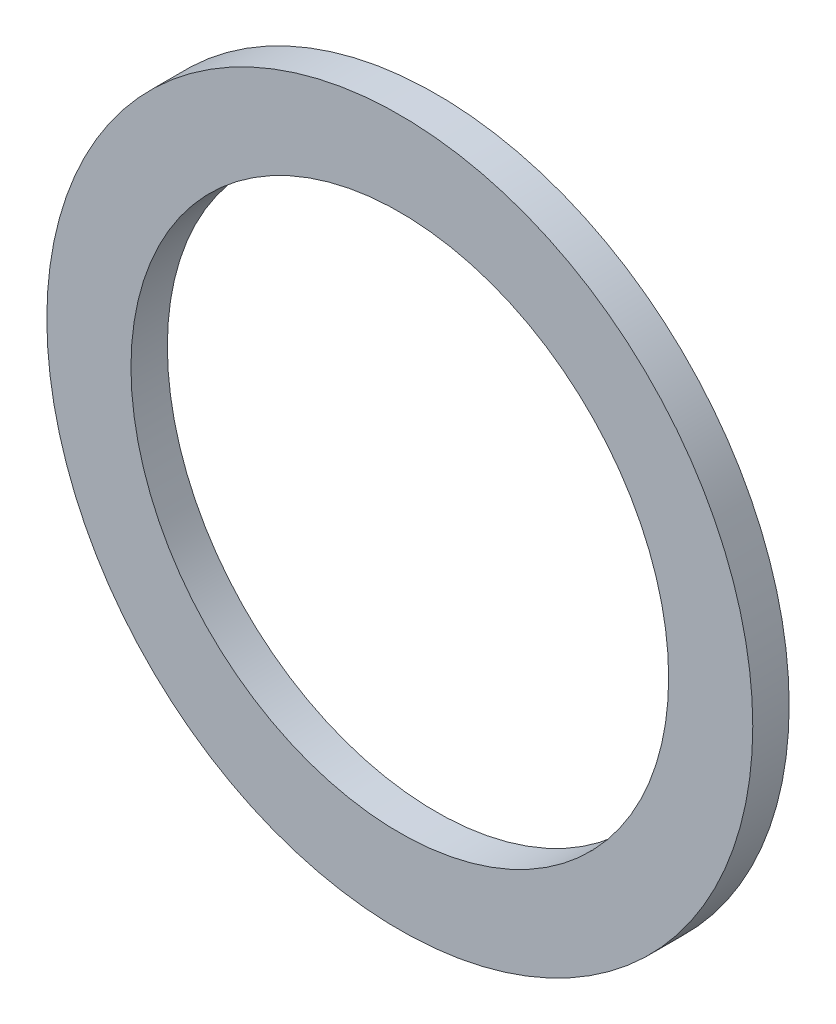
ISO-10303-21;
HEADER;
FILE_DESCRIPTION(('STEP AP214'),'2;1');
FILE_NAME('part.step','',(''),(''),'','','');
FILE_SCHEMA(('AUTOMOTIVE_DESIGN { 1 0 10303 214 1 1 1 1 }'));
ENDSEC;
DATA;
#1=APPLICATION_CONTEXT('core data for automotive mechanical design processes');
#2=APPLICATION_PROTOCOL_DEFINITION('international standard','automotive_design',2000,#1);
#3=PRODUCT_CONTEXT('',#1,'mechanical');
#4=PRODUCT('Part','Part','',(#3));
#5=PRODUCT_RELATED_PRODUCT_CATEGORY('part','',(#4));
#6=PRODUCT_DEFINITION_FORMATION('','',#4);
#7=PRODUCT_DEFINITION_CONTEXT('part definition',#1,'design');
#8=PRODUCT_DEFINITION('design','',#6,#7);
#9=PRODUCT_DEFINITION_SHAPE('','',#8);
#10=(LENGTH_UNIT() NAMED_UNIT(*) SI_UNIT(.MILLI.,.METRE.));
#11=(NAMED_UNIT(*) PLANE_ANGLE_UNIT() SI_UNIT($,.RADIAN.));
#12=(NAMED_UNIT(*) SI_UNIT($,.STERADIAN.) SOLID_ANGLE_UNIT());
#13=UNCERTAINTY_MEASURE_WITH_UNIT(LENGTH_MEASURE(1.E-05),#10,'distance_accuracy_value','');
#14=(GEOMETRIC_REPRESENTATION_CONTEXT(3) GLOBAL_UNCERTAINTY_ASSIGNED_CONTEXT((#13)) GLOBAL_UNIT_ASSIGNED_CONTEXT((#10,
#11,#12)) REPRESENTATION_CONTEXT('',''));
#15=CARTESIAN_POINT('',(0.,0.,0.));
#16=DIRECTION('',(0.,0.,1.));
#17=DIRECTION('',(1.,0.,0.));
#18=AXIS2_PLACEMENT_3D('',#15,#16,#17);
#19=CARTESIAN_POINT('',(0.,0.,0.8128));
#20=DIRECTION('',(0.,0.,1.));
#21=DIRECTION('',(1.,0.,0.));
#22=AXIS2_PLACEMENT_3D('',#19,#20,#21);
#23=PLANE('',#22);
#24=CARTESIAN_POINT('',(0.,0.,0.8128));
#25=DIRECTION('',(0.,0.,1.));
#26=DIRECTION('',(1.,0.,0.));
#27=AXIS2_PLACEMENT_3D('',#24,#25,#26);
#28=CIRCLE('',#27,7.8867);
#29=CARTESIAN_POINT('',(7.8867,0.,0.8128));
#30=VERTEX_POINT('',#29);
#31=EDGE_CURVE('E10',#30,#30,#28,.T.);
#32=ORIENTED_EDGE('',*,*,#31,.T.);
#33=EDGE_LOOP('',(#32));
#34=FACE_BOUND('',#33,.T.);
#35=CARTESIAN_POINT('',(0.,0.,0.8128));
#36=DIRECTION('',(0.,0.,1.));
#37=DIRECTION('',(1.,0.,0.));
#38=AXIS2_PLACEMENT_3D('',#35,#36,#37);
#39=CIRCLE('',#38,6.0071);
#40=CARTESIAN_POINT('',(6.0071,0.,0.8128));
#41=VERTEX_POINT('',#40);
#42=EDGE_CURVE('E42',#41,#41,#39,.T.);
#43=ORIENTED_EDGE('',*,*,#42,.F.);
#44=EDGE_LOOP('',(#43));
#45=FACE_BOUND('',#44,.T.);
#46=ADVANCED_FACE('F31',(#34,#45),#23,.T.);
#47=CARTESIAN_POINT('',(0.,0.,0.));
#48=DIRECTION('',(0.,0.,1.));
#49=DIRECTION('',(1.,0.,0.));
#50=AXIS2_PLACEMENT_3D('',#47,#48,#49);
#51=PLANE('',#50);
#52=CARTESIAN_POINT('',(0.,0.,0.));
#53=DIRECTION('',(0.,0.,1.));
#54=DIRECTION('',(1.,0.,0.));
#55=AXIS2_PLACEMENT_3D('',#52,#53,#54);
#56=CIRCLE('',#55,7.8867);
#57=CARTESIAN_POINT('',(7.8867,0.,0.));
#58=VERTEX_POINT('',#57);
#59=EDGE_CURVE('E35',#58,#58,#56,.T.);
#60=ORIENTED_EDGE('',*,*,#59,.F.);
#61=EDGE_LOOP('',(#60));
#62=FACE_BOUND('',#61,.T.);
#63=CARTESIAN_POINT('',(0.,0.,0.));
#64=DIRECTION('',(0.,0.,1.));
#65=DIRECTION('',(1.,0.,0.));
#66=AXIS2_PLACEMENT_3D('',#63,#64,#65);
#67=CIRCLE('',#66,6.0071);
#68=CARTESIAN_POINT('',(6.0071,0.,0.));
#69=VERTEX_POINT('',#68);
#70=EDGE_CURVE('E44',#69,#69,#67,.T.);
#71=ORIENTED_EDGE('',*,*,#70,.T.);
#72=EDGE_LOOP('',(#71));
#73=FACE_BOUND('',#72,.T.);
#74=ADVANCED_FACE('F54',(#62,#73),#51,.F.);
#75=CARTESIAN_POINT('',(0.,0.,0.8128));
#76=DIRECTION('',(0.,0.,-1.));
#77=DIRECTION('',(-1.,0.,0.));
#78=AXIS2_PLACEMENT_3D('',#75,#76,#77);
#79=CYLINDRICAL_SURFACE('',#78,7.8867);
#80=ORIENTED_EDGE('',*,*,#31,.F.);
#81=EDGE_LOOP('',(#80));
#82=FACE_BOUND('',#81,.T.);
#83=ORIENTED_EDGE('',*,*,#59,.T.);
#84=EDGE_LOOP('',(#83));
#85=FACE_BOUND('',#84,.T.);
#86=ADVANCED_FACE('F33',(#82,#85),#79,.T.);
#87=CARTESIAN_POINT('',(0.,0.,0.8128));
#88=DIRECTION('',(0.,0.,-1.));
#89=DIRECTION('',(-1.,0.,0.));
#90=AXIS2_PLACEMENT_3D('',#87,#88,#89);
#91=CYLINDRICAL_SURFACE('',#90,6.0071);
#92=ORIENTED_EDGE('',*,*,#42,.T.);
#93=EDGE_LOOP('',(#92));
#94=FACE_BOUND('',#93,.T.);
#95=ORIENTED_EDGE('',*,*,#70,.F.);
#96=EDGE_LOOP('',(#95));
#97=FACE_BOUND('',#96,.T.);
#98=ADVANCED_FACE('F50',(#94,#97),#91,.F.);
#99=CLOSED_SHELL('',(#46,#74,#86,#98));
#100=MANIFOLD_SOLID_BREP('B2',#99);
#101=ADVANCED_BREP_SHAPE_REPRESENTATION('',(#18,#100),#14);
#102=SHAPE_DEFINITION_REPRESENTATION(#9,#101);
ENDSEC;
END-ISO-10303-21;
